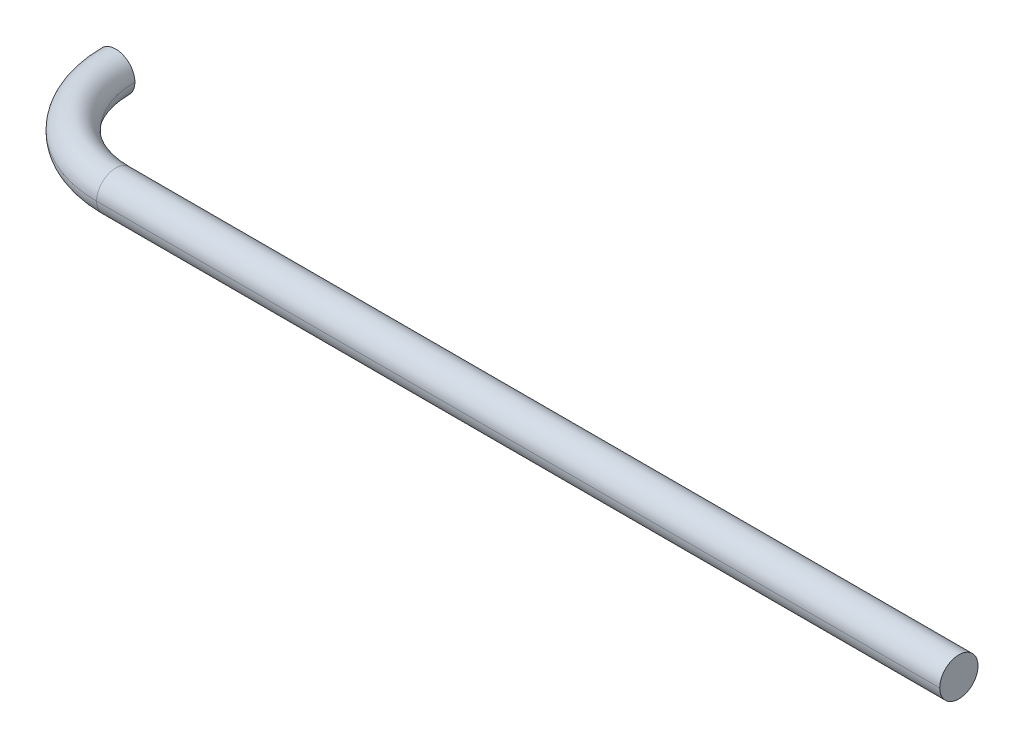
ISO-10303-21;
HEADER;
FILE_DESCRIPTION(('STEP AP214'),'2;1');
FILE_NAME('part.step','',(''),(''),'','','');
FILE_SCHEMA(('AUTOMOTIVE_DESIGN { 1 0 10303 214 1 1 1 1 }'));
ENDSEC;
DATA;
#1=APPLICATION_CONTEXT('core data for automotive mechanical design processes');
#2=APPLICATION_PROTOCOL_DEFINITION('international standard','automotive_design',2000,#1);
#3=PRODUCT_CONTEXT('',#1,'mechanical');
#4=PRODUCT('Part','Part','',(#3));
#5=PRODUCT_RELATED_PRODUCT_CATEGORY('part','',(#4));
#6=PRODUCT_DEFINITION_FORMATION('','',#4);
#7=PRODUCT_DEFINITION_CONTEXT('part definition',#1,'design');
#8=PRODUCT_DEFINITION('design','',#6,#7);
#9=PRODUCT_DEFINITION_SHAPE('','',#8);
#10=(LENGTH_UNIT() NAMED_UNIT(*) SI_UNIT(.MILLI.,.METRE.));
#11=(NAMED_UNIT(*) PLANE_ANGLE_UNIT() SI_UNIT($,.RADIAN.));
#12=(NAMED_UNIT(*) SI_UNIT($,.STERADIAN.) SOLID_ANGLE_UNIT());
#13=UNCERTAINTY_MEASURE_WITH_UNIT(LENGTH_MEASURE(1.E-05),#10,'distance_accuracy_value','');
#14=(GEOMETRIC_REPRESENTATION_CONTEXT(3) GLOBAL_UNCERTAINTY_ASSIGNED_CONTEXT((#13)) GLOBAL_UNIT_ASSIGNED_CONTEXT((#10,
#11,#12)) REPRESENTATION_CONTEXT('',''));
#15=CARTESIAN_POINT('',(0.,0.,0.));
#16=DIRECTION('',(0.,0.,1.));
#17=DIRECTION('',(1.,0.,0.));
#18=AXIS2_PLACEMENT_3D('',#15,#16,#17);
#19=CARTESIAN_POINT('',(3.4999999999986,0.,1.39727442019107E-12));
#20=DIRECTION('',(0.,1.,0.));
#21=DIRECTION('',(-1.,0.,-3.99221262911893E-13));
#22=AXIS2_PLACEMENT_3D('',#19,#20,#21);
#23=TOROIDAL_SURFACE('',#22,3.4999999999986,0.65);
#24=CARTESIAN_POINT('',(3.4999999999986,0.,1.39727442019107E-12));
#25=DIRECTION('',(0.,1.,0.));
#26=DIRECTION('',(0.,0.,1.));
#27=AXIS2_PLACEMENT_3D('',#24,#25,#26);
#28=CIRCLE('',#27,4.1499999999986);
#29=CARTESIAN_POINT('',(-0.65,0.,0.));
#30=VERTEX_POINT('',#29);
#31=CARTESIAN_POINT('',(3.49999999999748,0.,4.15));
#32=VERTEX_POINT('',#31);
#33=EDGE_CURVE('E92',#30,#32,#28,.T.);
#34=ORIENTED_EDGE('',*,*,#33,.F.);
#35=CARTESIAN_POINT('',(0.,0.,0.));
#36=DIRECTION('',(0.,0.,1.));
#37=DIRECTION('',(-1.,0.,0.));
#38=AXIS2_PLACEMENT_3D('',#35,#36,#37);
#39=CIRCLE('',#38,0.65);
#40=CARTESIAN_POINT('',(0.65,0.,0.));
#41=VERTEX_POINT('',#40);
#42=EDGE_CURVE('E28',#30,#41,#39,.T.);
#43=ORIENTED_EDGE('',*,*,#42,.T.);
#44=CARTESIAN_POINT('',(3.4999999999986,0.,1.39727442019107E-12));
#45=DIRECTION('',(0.,1.,0.));
#46=DIRECTION('',(0.,0.,1.));
#47=AXIS2_PLACEMENT_3D('',#44,#45,#46);
#48=CIRCLE('',#47,2.8499999999986);
#49=CARTESIAN_POINT('',(3.49999999999783,0.,2.85));
#50=VERTEX_POINT('',#49);
#51=EDGE_CURVE('E86',#41,#50,#48,.T.);
#52=ORIENTED_EDGE('',*,*,#51,.T.);
#53=CARTESIAN_POINT('',(3.49999999999765,0.,3.5));
#54=DIRECTION('',(1.,0.,2.71550944124062E-13));
#55=DIRECTION('',(-2.71550944124062E-13,0.,1.));
#56=AXIS2_PLACEMENT_3D('',#53,#54,#55);
#57=CIRCLE('',#56,0.65);
#58=EDGE_CURVE('E21',#32,#50,#57,.T.);
#59=ORIENTED_EDGE('',*,*,#58,.F.);
#60=EDGE_LOOP('',(#34,#43,#52,#59));
#61=FACE_BOUND('',#60,.T.);
#62=ADVANCED_FACE('F17',(#61),#23,.T.);
#63=CARTESIAN_POINT('',(3.49999999999765,0.,3.5));
#64=DIRECTION('',(1.,0.,0.));
#65=DIRECTION('',(0.,0.,1.));
#66=AXIS2_PLACEMENT_3D('',#63,#64,#65);
#67=CYLINDRICAL_SURFACE('',#66,0.65);
#68=DIRECTION('',(1.,0.,0.));
#69=VECTOR('',#68,1.);
#70=CARTESIAN_POINT('',(3.49999999999765,0.,2.85));
#71=LINE('',#70,#69);
#72=CARTESIAN_POINT('',(32.1389851691479,0.,2.85));
#73=VERTEX_POINT('',#72);
#74=EDGE_CURVE('E71',#50,#73,#71,.T.);
#75=ORIENTED_EDGE('',*,*,#74,.F.);
#76=CARTESIAN_POINT('',(3.49999999999765,0.,3.5));
#77=DIRECTION('',(1.,0.,2.71550944124062E-13));
#78=DIRECTION('',(-2.71550944124062E-13,0.,1.));
#79=AXIS2_PLACEMENT_3D('',#76,#77,#78);
#80=CIRCLE('',#79,0.65);
#81=EDGE_CURVE('E75',#50,#32,#80,.T.);
#82=ORIENTED_EDGE('',*,*,#81,.T.);
#83=DIRECTION('',(1.,0.,0.));
#84=VECTOR('',#83,1.);
#85=CARTESIAN_POINT('',(3.49999999999765,0.,4.15));
#86=LINE('',#85,#84);
#87=CARTESIAN_POINT('',(32.1389851691481,0.,4.15));
#88=VERTEX_POINT('',#87);
#89=EDGE_CURVE('E84',#32,#88,#86,.T.);
#90=ORIENTED_EDGE('',*,*,#89,.T.);
#91=CARTESIAN_POINT('',(32.138985169148,0.,3.5));
#92=DIRECTION('',(1.,0.,-1.28102656687518E-13));
#93=DIRECTION('',(1.28102656687518E-13,0.,1.));
#94=AXIS2_PLACEMENT_3D('',#91,#92,#93);
#95=CIRCLE('',#94,0.65);
#96=EDGE_CURVE('E11',#73,#88,#95,.T.);
#97=ORIENTED_EDGE('',*,*,#96,.F.);
#98=EDGE_LOOP('',(#75,#82,#90,#97));
#99=FACE_BOUND('',#98,.T.);
#100=ADVANCED_FACE('F73',(#99),#67,.T.);
#101=CARTESIAN_POINT('',(32.138985169148,0.,3.5));
#102=DIRECTION('',(1.,0.,-1.27491950812021E-13));
#103=DIRECTION('',(-1.27491950812021E-13,0.,-1.));
#104=AXIS2_PLACEMENT_3D('',#101,#102,#103);
#105=PLANE('',#104);
#106=CARTESIAN_POINT('',(32.138985169148,0.,3.5));
#107=DIRECTION('',(1.,0.,-1.28102656687518E-13));
#108=DIRECTION('',(1.28102656687518E-13,0.,1.));
#109=AXIS2_PLACEMENT_3D('',#106,#107,#108);
#110=CIRCLE('',#109,0.65);
#111=EDGE_CURVE('E80',#88,#73,#110,.T.);
#112=ORIENTED_EDGE('',*,*,#111,.T.);
#113=ORIENTED_EDGE('',*,*,#96,.T.);
#114=EDGE_LOOP('',(#112,#113));
#115=FACE_BOUND('',#114,.T.);
#116=ADVANCED_FACE('F19',(#115),#105,.T.);
#117=CARTESIAN_POINT('',(0.,0.,0.));
#118=DIRECTION('',(0.,0.,1.));
#119=DIRECTION('',(1.,0.,0.));
#120=AXIS2_PLACEMENT_3D('',#117,#118,#119);
#121=PLANE('',#120);
#122=CARTESIAN_POINT('',(0.,0.,0.));
#123=DIRECTION('',(0.,0.,1.));
#124=DIRECTION('',(-1.,0.,0.));
#125=AXIS2_PLACEMENT_3D('',#122,#123,#124);
#126=CIRCLE('',#125,0.65);
#127=EDGE_CURVE('E99',#41,#30,#126,.T.);
#128=ORIENTED_EDGE('',*,*,#127,.F.);
#129=ORIENTED_EDGE('',*,*,#42,.F.);
#130=EDGE_LOOP('',(#128,#129));
#131=FACE_BOUND('',#130,.T.);
#132=ADVANCED_FACE('F107',(#131),#121,.F.);
#133=CARTESIAN_POINT('',(3.49999999999765,0.,3.5));
#134=DIRECTION('',(1.,0.,0.));
#135=DIRECTION('',(0.,0.,1.));
#136=AXIS2_PLACEMENT_3D('',#133,#134,#135);
#137=CYLINDRICAL_SURFACE('',#136,0.65);
#138=ORIENTED_EDGE('',*,*,#58,.T.);
#139=ORIENTED_EDGE('',*,*,#74,.T.);
#140=ORIENTED_EDGE('',*,*,#111,.F.);
#141=ORIENTED_EDGE('',*,*,#89,.F.);
#142=EDGE_LOOP('',(#138,#139,#140,#141));
#143=FACE_BOUND('',#142,.T.);
#144=ADVANCED_FACE('F83',(#143),#137,.T.);
#145=CARTESIAN_POINT('',(3.4999999999986,0.,1.39727442019107E-12));
#146=DIRECTION('',(0.,1.,0.));
#147=DIRECTION('',(-1.,0.,-3.99221262911893E-13));
#148=AXIS2_PLACEMENT_3D('',#145,#146,#147);
#149=TOROIDAL_SURFACE('',#148,3.4999999999986,0.65);
#150=ORIENTED_EDGE('',*,*,#127,.T.);
#151=ORIENTED_EDGE('',*,*,#33,.T.);
#152=ORIENTED_EDGE('',*,*,#81,.F.);
#153=ORIENTED_EDGE('',*,*,#51,.F.);
#154=EDGE_LOOP('',(#150,#151,#152,#153));
#155=FACE_BOUND('',#154,.T.);
#156=ADVANCED_FACE('F91',(#155),#149,.T.);
#157=CLOSED_SHELL('',(#62,#100,#116,#132,#144,#156));
#158=MANIFOLD_SOLID_BREP('B1',#157);
#159=ADVANCED_BREP_SHAPE_REPRESENTATION('',(#18,#158),#14);
#160=SHAPE_DEFINITION_REPRESENTATION(#9,#159);
ENDSEC;
END-ISO-10303-21;
